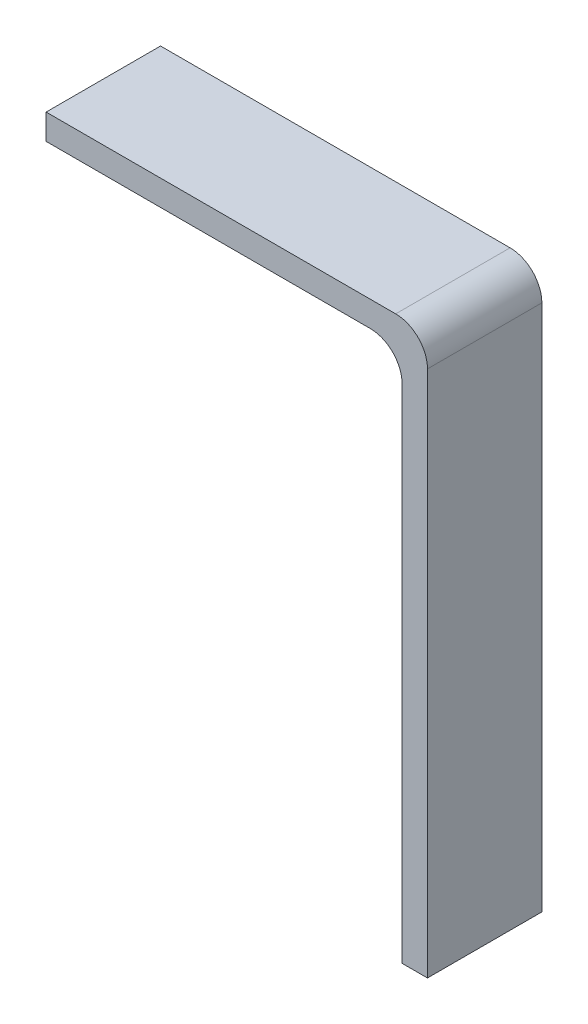
ISO-10303-21;
HEADER;
FILE_DESCRIPTION(('STEP AP214'),'2;1');
FILE_NAME('part.step','',(''),(''),'','','');
FILE_SCHEMA(('AUTOMOTIVE_DESIGN { 1 0 10303 214 1 1 1 1 }'));
ENDSEC;
DATA;
#1=APPLICATION_CONTEXT('core data for automotive mechanical design processes');
#2=APPLICATION_PROTOCOL_DEFINITION('international standard','automotive_design',2000,#1);
#3=PRODUCT_CONTEXT('',#1,'mechanical');
#4=PRODUCT('Part','Part','',(#3));
#5=PRODUCT_RELATED_PRODUCT_CATEGORY('part','',(#4));
#6=PRODUCT_DEFINITION_FORMATION('','',#4);
#7=PRODUCT_DEFINITION_CONTEXT('part definition',#1,'design');
#8=PRODUCT_DEFINITION('design','',#6,#7);
#9=PRODUCT_DEFINITION_SHAPE('','',#8);
#10=(LENGTH_UNIT() NAMED_UNIT(*) SI_UNIT(.MILLI.,.METRE.));
#11=(NAMED_UNIT(*) PLANE_ANGLE_UNIT() SI_UNIT($,.RADIAN.));
#12=(NAMED_UNIT(*) SI_UNIT($,.STERADIAN.) SOLID_ANGLE_UNIT());
#13=UNCERTAINTY_MEASURE_WITH_UNIT(LENGTH_MEASURE(1.E-05),#10,'distance_accuracy_value','');
#14=(GEOMETRIC_REPRESENTATION_CONTEXT(3) GLOBAL_UNCERTAINTY_ASSIGNED_CONTEXT((#13)) GLOBAL_UNIT_ASSIGNED_CONTEXT((#10,
#11,#12)) REPRESENTATION_CONTEXT('',''));
#15=CARTESIAN_POINT('',(0.,0.,0.));
#16=DIRECTION('',(0.,0.,1.));
#17=DIRECTION('',(1.,0.,0.));
#18=AXIS2_PLACEMENT_3D('',#15,#16,#17);
#19=CARTESIAN_POINT('',(0.,0.2,0.));
#20=DIRECTION('',(0.,1.,0.));
#21=DIRECTION('',(0.,0.,1.));
#22=AXIS2_PLACEMENT_3D('',#19,#20,#21);
#23=PLANE('',#22);
#24=DIRECTION('',(1.,0.,0.));
#25=VECTOR('',#24,1.);
#26=CARTESIAN_POINT('',(1.,0.2,-0.45));
#27=LINE('',#26,#25);
#28=CARTESIAN_POINT('',(0.75,0.2,-0.45));
#29=VERTEX_POINT('',#28);
#30=CARTESIAN_POINT('',(-2.,0.2,-0.45));
#31=VERTEX_POINT('',#30);
#32=EDGE_CURVE('E133',#29,#31,#27,.F.);
#33=ORIENTED_EDGE('',*,*,#32,.T.);
#34=DIRECTION('',(0.,0.,1.));
#35=VECTOR('',#34,1.);
#36=CARTESIAN_POINT('',(-2.,0.2,0.));
#37=LINE('',#36,#35);
#38=CARTESIAN_POINT('',(-2.,0.2,0.45));
#39=VERTEX_POINT('',#38);
#40=EDGE_CURVE('E128',#39,#31,#37,.F.);
#41=ORIENTED_EDGE('',*,*,#40,.F.);
#42=DIRECTION('',(-1.,0.,0.));
#43=VECTOR('',#42,1.);
#44=CARTESIAN_POINT('',(1.,0.2,0.45));
#45=LINE('',#44,#43);
#46=CARTESIAN_POINT('',(0.75,0.2,0.45));
#47=VERTEX_POINT('',#46);
#48=EDGE_CURVE('E107',#39,#47,#45,.F.);
#49=ORIENTED_EDGE('',*,*,#48,.T.);
#50=DIRECTION('',(0.,0.,1.));
#51=VECTOR('',#50,1.);
#52=CARTESIAN_POINT('',(0.75,0.2,0.));
#53=LINE('',#52,#51);
#54=EDGE_CURVE('E116',#29,#47,#53,.T.);
#55=ORIENTED_EDGE('',*,*,#54,.F.);
#56=EDGE_LOOP('',(#33,#41,#49,#55));
#57=FACE_BOUND('',#56,.T.);
#58=ADVANCED_FACE('F17',(#57),#23,.T.);
#59=CARTESIAN_POINT('',(-2.,0.,0.));
#60=DIRECTION('',(-1.,0.,0.));
#61=DIRECTION('',(0.,0.,1.));
#62=AXIS2_PLACEMENT_3D('',#59,#60,#61);
#63=PLANE('',#62);
#64=ORIENTED_EDGE('',*,*,#40,.T.);
#65=DIRECTION('',(0.,1.,0.));
#66=VECTOR('',#65,1.);
#67=CARTESIAN_POINT('',(-2.,-3.3,-0.45));
#68=LINE('',#67,#66);
#69=CARTESIAN_POINT('',(-2.,0.,-0.45));
#70=VERTEX_POINT('',#69);
#71=EDGE_CURVE('E131',#31,#70,#68,.F.);
#72=ORIENTED_EDGE('',*,*,#71,.T.);
#73=DIRECTION('',(0.,0.,-1.));
#74=VECTOR('',#73,1.);
#75=CARTESIAN_POINT('',(-2.,0.,0.));
#76=LINE('',#75,#74);
#77=CARTESIAN_POINT('',(-2.,0.,0.45));
#78=VERTEX_POINT('',#77);
#79=EDGE_CURVE('E95',#78,#70,#76,.T.);
#80=ORIENTED_EDGE('',*,*,#79,.F.);
#81=DIRECTION('',(0.,1.,0.));
#82=VECTOR('',#81,1.);
#83=CARTESIAN_POINT('',(-2.,-6.8,0.45));
#84=LINE('',#83,#82);
#85=EDGE_CURVE('E105',#78,#39,#84,.T.);
#86=ORIENTED_EDGE('',*,*,#85,.T.);
#87=EDGE_LOOP('',(#64,#72,#80,#86));
#88=FACE_BOUND('',#87,.T.);
#89=ADVANCED_FACE('F195',(#88),#63,.T.);
#90=CARTESIAN_POINT('',(0.55,0.,0.));
#91=DIRECTION('',(0.,-1.,0.));
#92=DIRECTION('',(0.,0.,-1.));
#93=AXIS2_PLACEMENT_3D('',#90,#91,#92);
#94=PLANE('',#93);
#95=DIRECTION('',(1.,0.,0.));
#96=VECTOR('',#95,1.);
#97=CARTESIAN_POINT('',(1.,0.,-0.45));
#98=LINE('',#97,#96);
#99=CARTESIAN_POINT('',(0.55,0.,-0.45));
#100=VERTEX_POINT('',#99);
#101=EDGE_CURVE('E93',#70,#100,#98,.T.);
#102=ORIENTED_EDGE('',*,*,#101,.T.);
#103=DIRECTION('',(0.,0.,1.));
#104=VECTOR('',#103,1.);
#105=CARTESIAN_POINT('',(0.55,0.,0.));
#106=LINE('',#105,#104);
#107=CARTESIAN_POINT('',(0.55,0.,0.45));
#108=VERTEX_POINT('',#107);
#109=EDGE_CURVE('E86',#100,#108,#106,.T.);
#110=ORIENTED_EDGE('',*,*,#109,.T.);
#111=DIRECTION('',(-1.,0.,0.));
#112=VECTOR('',#111,1.);
#113=CARTESIAN_POINT('',(1.,0.,0.45));
#114=LINE('',#113,#112);
#115=EDGE_CURVE('E90',#108,#78,#114,.T.);
#116=ORIENTED_EDGE('',*,*,#115,.T.);
#117=ORIENTED_EDGE('',*,*,#79,.T.);
#118=EDGE_LOOP('',(#102,#110,#116,#117));
#119=FACE_BOUND('',#118,.T.);
#120=ADVANCED_FACE('F87',(#119),#94,.T.);
#121=CARTESIAN_POINT('',(0.55,-0.25,0.));
#122=DIRECTION('',(0.,0.,1.));
#123=DIRECTION('',(1.,0.,0.));
#124=AXIS2_PLACEMENT_3D('',#121,#122,#123);
#125=CYLINDRICAL_SURFACE('',#124,0.25);
#126=DIRECTION('',(0.,0.,1.));
#127=VECTOR('',#126,1.);
#128=CARTESIAN_POINT('',(0.8,-0.25,0.));
#129=LINE('',#128,#127);
#130=CARTESIAN_POINT('',(0.8,-0.25,0.45));
#131=VERTEX_POINT('',#130);
#132=CARTESIAN_POINT('',(0.8,-0.25,-0.45));
#133=VERTEX_POINT('',#132);
#134=EDGE_CURVE('E80',#131,#133,#129,.F.);
#135=ORIENTED_EDGE('',*,*,#134,.F.);
#136=CARTESIAN_POINT('',(0.55,-0.25,0.45));
#137=DIRECTION('',(0.,0.,1.));
#138=DIRECTION('',(1.,0.,0.));
#139=AXIS2_PLACEMENT_3D('',#136,#137,#138);
#140=CIRCLE('',#139,0.25);
#141=EDGE_CURVE('E20',#131,#108,#140,.T.);
#142=ORIENTED_EDGE('',*,*,#141,.T.);
#143=ORIENTED_EDGE('',*,*,#109,.F.);
#144=CARTESIAN_POINT('',(0.55,-0.25,-0.45));
#145=DIRECTION('',(0.,0.,1.));
#146=DIRECTION('',(1.,0.,0.));
#147=AXIS2_PLACEMENT_3D('',#144,#145,#146);
#148=CIRCLE('',#147,0.25);
#149=EDGE_CURVE('E144',#100,#133,#148,.F.);
#150=ORIENTED_EDGE('',*,*,#149,.T.);
#151=EDGE_LOOP('',(#135,#142,#143,#150));
#152=FACE_BOUND('',#151,.T.);
#153=ADVANCED_FACE('F98',(#152),#125,.F.);
#154=CARTESIAN_POINT('',(0.8,-6.8,0.));
#155=DIRECTION('',(-1.,0.,0.));
#156=DIRECTION('',(0.,0.,1.));
#157=AXIS2_PLACEMENT_3D('',#154,#155,#156);
#158=PLANE('',#157);
#159=DIRECTION('',(0.,0.,1.));
#160=VECTOR('',#159,1.);
#161=CARTESIAN_POINT('',(0.8,-4.2,-0.991279317167));
#162=LINE('',#161,#160);
#163=CARTESIAN_POINT('',(0.8,-4.2,-0.45));
#164=VERTEX_POINT('',#163);
#165=CARTESIAN_POINT('',(0.8,-4.2,0.45));
#166=VERTEX_POINT('',#165);
#167=EDGE_CURVE('E119',#164,#166,#162,.T.);
#168=ORIENTED_EDGE('',*,*,#167,.T.);
#169=DIRECTION('',(0.,1.,0.));
#170=VECTOR('',#169,1.);
#171=CARTESIAN_POINT('',(0.8,-6.8,0.45));
#172=LINE('',#171,#170);
#173=EDGE_CURVE('E100',#166,#131,#172,.T.);
#174=ORIENTED_EDGE('',*,*,#173,.T.);
#175=ORIENTED_EDGE('',*,*,#134,.T.);
#176=DIRECTION('',(0.,1.,0.));
#177=VECTOR('',#176,1.);
#178=CARTESIAN_POINT('',(0.8,-3.3,-0.45));
#179=LINE('',#178,#177);
#180=EDGE_CURVE('E146',#133,#164,#179,.F.);
#181=ORIENTED_EDGE('',*,*,#180,.T.);
#182=EDGE_LOOP('',(#168,#174,#175,#181));
#183=FACE_BOUND('',#182,.T.);
#184=ADVANCED_FACE('F183',(#183),#158,.T.);
#185=CARTESIAN_POINT('',(0.75,-0.05,0.));
#186=DIRECTION('',(0.,0.,1.));
#187=DIRECTION('',(1.,0.,0.));
#188=AXIS2_PLACEMENT_3D('',#185,#186,#187);
#189=CYLINDRICAL_SURFACE('',#188,0.25);
#190=CARTESIAN_POINT('',(0.75,-0.05,-0.45));
#191=DIRECTION('',(0.,0.,1.));
#192=DIRECTION('',(1.,0.,0.));
#193=AXIS2_PLACEMENT_3D('',#190,#191,#192);
#194=CIRCLE('',#193,0.25);
#195=CARTESIAN_POINT('',(1.,-0.05,-0.45));
#196=VERTEX_POINT('',#195);
#197=EDGE_CURVE('E122',#196,#29,#194,.T.);
#198=ORIENTED_EDGE('',*,*,#197,.T.);
#199=ORIENTED_EDGE('',*,*,#54,.T.);
#200=CARTESIAN_POINT('',(0.75,-0.05,0.45));
#201=DIRECTION('',(0.,0.,1.));
#202=DIRECTION('',(1.,0.,0.));
#203=AXIS2_PLACEMENT_3D('',#200,#201,#202);
#204=CIRCLE('',#203,0.25);
#205=CARTESIAN_POINT('',(1.,-0.05,0.45));
#206=VERTEX_POINT('',#205);
#207=EDGE_CURVE('E148',#47,#206,#204,.F.);
#208=ORIENTED_EDGE('',*,*,#207,.T.);
#209=DIRECTION('',(0.,0.,-1.));
#210=VECTOR('',#209,1.);
#211=CARTESIAN_POINT('',(1.,-0.05,0.));
#212=LINE('',#211,#210);
#213=EDGE_CURVE('E159',#196,#206,#212,.F.);
#214=ORIENTED_EDGE('',*,*,#213,.F.);
#215=EDGE_LOOP('',(#198,#199,#208,#214));
#216=FACE_BOUND('',#215,.T.);
#217=ADVANCED_FACE('F192',(#216),#189,.T.);
#218=CARTESIAN_POINT('',(1.,-6.8,0.45));
#219=DIRECTION('',(0.,0.,-1.));
#220=DIRECTION('',(-1.,0.,0.));
#221=AXIS2_PLACEMENT_3D('',#218,#219,#220);
#222=PLANE('',#221);
#223=DIRECTION('',(0.,1.,0.));
#224=VECTOR('',#223,1.);
#225=CARTESIAN_POINT('',(1.,-0.05,0.45));
#226=LINE('',#225,#224);
#227=CARTESIAN_POINT('',(1.,-4.2,0.45));
#228=VERTEX_POINT('',#227);
#229=EDGE_CURVE('E156',#206,#228,#226,.F.);
#230=ORIENTED_EDGE('',*,*,#229,.F.);
#231=ORIENTED_EDGE('',*,*,#207,.F.);
#232=ORIENTED_EDGE('',*,*,#48,.F.);
#233=ORIENTED_EDGE('',*,*,#85,.F.);
#234=ORIENTED_EDGE('',*,*,#115,.F.);
#235=ORIENTED_EDGE('',*,*,#141,.F.);
#236=ORIENTED_EDGE('',*,*,#173,.F.);
#237=DIRECTION('',(1.,0.,0.));
#238=VECTOR('',#237,1.);
#239=CARTESIAN_POINT('',(-0.001103077640641,-4.2,0.45));
#240=LINE('',#239,#238);
#241=EDGE_CURVE('E123',#166,#228,#240,.T.);
#242=ORIENTED_EDGE('',*,*,#241,.T.);
#243=EDGE_LOOP('',(#230,#231,#232,#233,#234,#235,#236,#242));
#244=FACE_BOUND('',#243,.T.);
#245=ADVANCED_FACE('F102',(#244),#222,.F.);
#246=CARTESIAN_POINT('',(-0.001103077640641,-4.2,-0.991279317167));
#247=DIRECTION('',(0.,1.,0.));
#248=DIRECTION('',(0.,0.,1.));
#249=AXIS2_PLACEMENT_3D('',#246,#247,#248);
#250=PLANE('',#249);
#251=DIRECTION('',(1.,0.,0.));
#252=VECTOR('',#251,1.);
#253=CARTESIAN_POINT('',(1.,-4.2,-0.45));
#254=LINE('',#253,#252);
#255=CARTESIAN_POINT('',(1.,-4.2,-0.45));
#256=VERTEX_POINT('',#255);
#257=EDGE_CURVE('E35',#164,#256,#254,.T.);
#258=ORIENTED_EDGE('',*,*,#257,.T.);
#259=DIRECTION('',(0.,0.,-1.));
#260=VECTOR('',#259,1.);
#261=CARTESIAN_POINT('',(1.,-4.2,0.));
#262=LINE('',#261,#260);
#263=EDGE_CURVE('E26',#228,#256,#262,.T.);
#264=ORIENTED_EDGE('',*,*,#263,.F.);
#265=ORIENTED_EDGE('',*,*,#241,.F.);
#266=ORIENTED_EDGE('',*,*,#167,.F.);
#267=EDGE_LOOP('',(#258,#264,#265,#266));
#268=FACE_BOUND('',#267,.T.);
#269=ADVANCED_FACE('F186',(#268),#250,.F.);
#270=CARTESIAN_POINT('',(1.,-3.3,-0.45));
#271=DIRECTION('',(0.,0.,1.));
#272=DIRECTION('',(1.,0.,0.));
#273=AXIS2_PLACEMENT_3D('',#270,#271,#272);
#274=PLANE('',#273);
#275=ORIENTED_EDGE('',*,*,#180,.F.);
#276=ORIENTED_EDGE('',*,*,#149,.F.);
#277=ORIENTED_EDGE('',*,*,#101,.F.);
#278=ORIENTED_EDGE('',*,*,#71,.F.);
#279=ORIENTED_EDGE('',*,*,#32,.F.);
#280=ORIENTED_EDGE('',*,*,#197,.F.);
#281=DIRECTION('',(0.,1.,0.));
#282=VECTOR('',#281,1.);
#283=CARTESIAN_POINT('',(1.,-0.05,-0.45));
#284=LINE('',#283,#282);
#285=EDGE_CURVE('E11',#256,#196,#284,.T.);
#286=ORIENTED_EDGE('',*,*,#285,.F.);
#287=ORIENTED_EDGE('',*,*,#257,.F.);
#288=EDGE_LOOP('',(#275,#276,#277,#278,#279,#280,#286,#287));
#289=FACE_BOUND('',#288,.T.);
#290=ADVANCED_FACE('F187',(#289),#274,.F.);
#291=CARTESIAN_POINT('',(1.,-0.05,0.));
#292=DIRECTION('',(1.,0.,0.));
#293=DIRECTION('',(0.,0.,-1.));
#294=AXIS2_PLACEMENT_3D('',#291,#292,#293);
#295=PLANE('',#294);
#296=ORIENTED_EDGE('',*,*,#263,.T.);
#297=ORIENTED_EDGE('',*,*,#285,.T.);
#298=ORIENTED_EDGE('',*,*,#213,.T.);
#299=ORIENTED_EDGE('',*,*,#229,.T.);
#300=EDGE_LOOP('',(#296,#297,#298,#299));
#301=FACE_BOUND('',#300,.T.);
#302=ADVANCED_FACE('F191',(#301),#295,.T.);
#303=CLOSED_SHELL('',(#58,#89,#120,#153,#184,#217,#245,#269,#290,#302));
#304=MANIFOLD_SOLID_BREP('B1',#303);
#305=ADVANCED_BREP_SHAPE_REPRESENTATION('',(#18,#304),#14);
#306=SHAPE_DEFINITION_REPRESENTATION(#9,#305);
ENDSEC;
END-ISO-10303-21;
